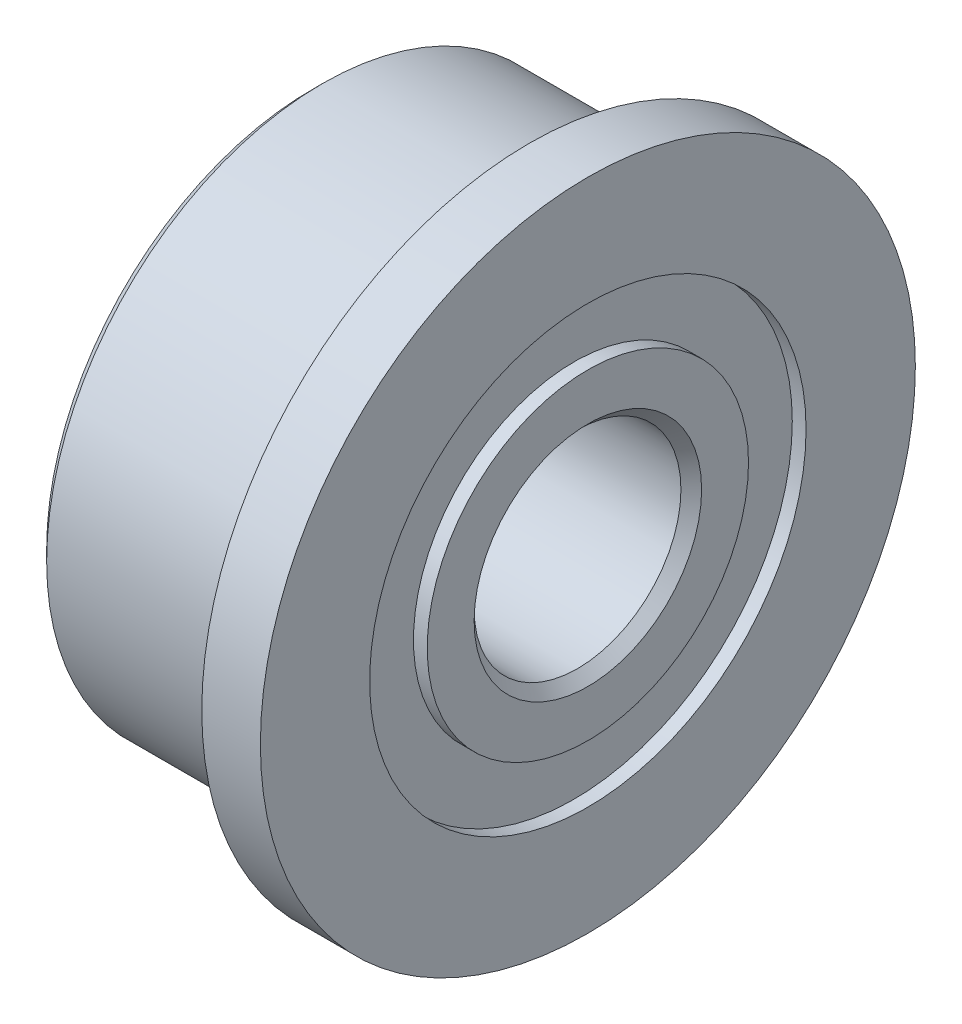
ISO-10303-21;
HEADER;
FILE_DESCRIPTION(('STEP AP214'),'2;1');
FILE_NAME('part.step','',(''),(''),'','','');
FILE_SCHEMA(('AUTOMOTIVE_DESIGN { 1 0 10303 214 1 1 1 1 }'));
ENDSEC;
DATA;
#1=APPLICATION_CONTEXT('core data for automotive mechanical design processes');
#2=APPLICATION_PROTOCOL_DEFINITION('international standard','automotive_design',2000,#1);
#3=PRODUCT_CONTEXT('',#1,'mechanical');
#4=PRODUCT('Part','Part','',(#3));
#5=PRODUCT_RELATED_PRODUCT_CATEGORY('part','',(#4));
#6=PRODUCT_DEFINITION_FORMATION('','',#4);
#7=PRODUCT_DEFINITION_CONTEXT('part definition',#1,'design');
#8=PRODUCT_DEFINITION('design','',#6,#7);
#9=PRODUCT_DEFINITION_SHAPE('','',#8);
#10=(LENGTH_UNIT() NAMED_UNIT(*) SI_UNIT(.MILLI.,.METRE.));
#11=(NAMED_UNIT(*) PLANE_ANGLE_UNIT() SI_UNIT($,.RADIAN.));
#12=(NAMED_UNIT(*) SI_UNIT($,.STERADIAN.) SOLID_ANGLE_UNIT());
#13=UNCERTAINTY_MEASURE_WITH_UNIT(LENGTH_MEASURE(1.E-05),#10,'distance_accuracy_value','');
#14=(GEOMETRIC_REPRESENTATION_CONTEXT(3) GLOBAL_UNCERTAINTY_ASSIGNED_CONTEXT((#13)) GLOBAL_UNIT_ASSIGNED_CONTEXT((#10,
#11,#12)) REPRESENTATION_CONTEXT('',''));
#15=CARTESIAN_POINT('',(0.,0.,0.));
#16=DIRECTION('',(0.,0.,1.));
#17=DIRECTION('',(1.,0.,0.));
#18=AXIS2_PLACEMENT_3D('',#15,#16,#17);
#19=CARTESIAN_POINT('',(-4.,2.33,0.));
#20=DIRECTION('',(-1.,0.,0.));
#21=DIRECTION('',(0.,0.,1.));
#22=AXIS2_PLACEMENT_3D('',#19,#20,#21);
#23=PLANE('',#22);
#24=CARTESIAN_POINT('',(-4.,0.,0.));
#25=DIRECTION('',(-1.,0.,0.));
#26=DIRECTION('',(0.,0.,1.));
#27=AXIS2_PLACEMENT_3D('',#24,#25,#26);
#28=CIRCLE('',#27,1.65);
#29=CARTESIAN_POINT('',(-4.,0.,1.65));
#30=VERTEX_POINT('',#29);
#31=EDGE_CURVE('E42',#30,#30,#28,.F.);
#32=ORIENTED_EDGE('',*,*,#31,.T.);
#33=EDGE_LOOP('',(#32));
#34=FACE_BOUND('',#33,.T.);
#35=CARTESIAN_POINT('',(-4.,0.,0.));
#36=DIRECTION('',(1.,0.,0.));
#37=DIRECTION('',(0.,0.,-1.));
#38=AXIS2_PLACEMENT_3D('',#35,#36,#37);
#39=CIRCLE('',#38,2.33);
#40=CARTESIAN_POINT('',(-4.,0.,-2.33));
#41=VERTEX_POINT('',#40);
#42=EDGE_CURVE('E90',#41,#41,#39,.T.);
#43=ORIENTED_EDGE('',*,*,#42,.F.);
#44=EDGE_LOOP('',(#43));
#45=FACE_BOUND('',#44,.T.);
#46=ADVANCED_FACE('F32',(#34,#45),#23,.T.);
#47=CARTESIAN_POINT('',(0.,0.,0.));
#48=DIRECTION('',(1.,0.,0.));
#49=DIRECTION('',(0.,0.,-1.));
#50=AXIS2_PLACEMENT_3D('',#47,#48,#49);
#51=CYLINDRICAL_SURFACE('',#50,1.5);
#52=CARTESIAN_POINT('',(-0.149999999999999,0.,0.));
#53=DIRECTION('',(1.,0.,0.));
#54=DIRECTION('',(0.,0.,-1.));
#55=AXIS2_PLACEMENT_3D('',#52,#53,#54);
#56=CIRCLE('',#55,1.5);
#57=CARTESIAN_POINT('',(-0.149999999999999,0.,-1.5));
#58=VERTEX_POINT('',#57);
#59=EDGE_CURVE('E51',#58,#58,#56,.T.);
#60=ORIENTED_EDGE('',*,*,#59,.T.);
#61=EDGE_LOOP('',(#60));
#62=FACE_BOUND('',#61,.T.);
#63=CARTESIAN_POINT('',(-3.85,0.,0.));
#64=DIRECTION('',(-1.,0.,0.));
#65=DIRECTION('',(0.,0.,1.));
#66=AXIS2_PLACEMENT_3D('',#63,#64,#65);
#67=CIRCLE('',#66,1.5);
#68=CARTESIAN_POINT('',(-3.85,0.,1.5));
#69=VERTEX_POINT('',#68);
#70=EDGE_CURVE('E54',#69,#69,#67,.T.);
#71=ORIENTED_EDGE('',*,*,#70,.T.);
#72=EDGE_LOOP('',(#71));
#73=FACE_BOUND('',#72,.T.);
#74=ADVANCED_FACE('F98',(#62,#73),#51,.F.);
#75=CARTESIAN_POINT('',(0.,1.5,0.));
#76=DIRECTION('',(1.,0.,0.));
#77=DIRECTION('',(0.,0.,-1.));
#78=AXIS2_PLACEMENT_3D('',#75,#76,#77);
#79=PLANE('',#78);
#80=CARTESIAN_POINT('',(0.,0.,0.));
#81=DIRECTION('',(1.,0.,0.));
#82=DIRECTION('',(0.,0.,-1.));
#83=AXIS2_PLACEMENT_3D('',#80,#81,#82);
#84=CIRCLE('',#83,1.65);
#85=CARTESIAN_POINT('',(0.,0.,-1.65));
#86=VERTEX_POINT('',#85);
#87=EDGE_CURVE('E46',#86,#86,#84,.F.);
#88=ORIENTED_EDGE('',*,*,#87,.T.);
#89=EDGE_LOOP('',(#88));
#90=FACE_BOUND('',#89,.T.);
#91=CARTESIAN_POINT('',(0.,0.,0.));
#92=DIRECTION('',(1.,0.,0.));
#93=DIRECTION('',(0.,0.,-1.));
#94=AXIS2_PLACEMENT_3D('',#91,#92,#93);
#95=CIRCLE('',#94,2.33);
#96=CARTESIAN_POINT('',(0.,0.,-2.33));
#97=VERTEX_POINT('',#96);
#98=EDGE_CURVE('E57',#97,#97,#95,.T.);
#99=ORIENTED_EDGE('',*,*,#98,.T.);
#100=EDGE_LOOP('',(#99));
#101=FACE_BOUND('',#100,.T.);
#102=ADVANCED_FACE('F103',(#90,#101),#79,.T.);
#103=CARTESIAN_POINT('',(0.,0.,0.));
#104=DIRECTION('',(1.,0.,0.));
#105=DIRECTION('',(0.,0.,-1.));
#106=AXIS2_PLACEMENT_3D('',#103,#104,#105);
#107=CYLINDRICAL_SURFACE('',#106,2.33);
#108=CARTESIAN_POINT('',(-0.2,0.,0.));
#109=DIRECTION('',(1.,0.,0.));
#110=DIRECTION('',(0.,0.,-1.));
#111=AXIS2_PLACEMENT_3D('',#108,#109,#110);
#112=CIRCLE('',#111,2.33);
#113=CARTESIAN_POINT('',(-0.2,0.,-2.33));
#114=VERTEX_POINT('',#113);
#115=EDGE_CURVE('E60',#114,#114,#112,.T.);
#116=ORIENTED_EDGE('',*,*,#115,.T.);
#117=EDGE_LOOP('',(#116));
#118=FACE_BOUND('',#117,.T.);
#119=ORIENTED_EDGE('',*,*,#98,.F.);
#120=EDGE_LOOP('',(#119));
#121=FACE_BOUND('',#120,.T.);
#122=ADVANCED_FACE('F162',(#118,#121),#107,.T.);
#123=CARTESIAN_POINT('',(-0.2,3.165,0.));
#124=DIRECTION('',(1.,0.,0.));
#125=DIRECTION('',(0.,0.,-1.));
#126=AXIS2_PLACEMENT_3D('',#123,#124,#125);
#127=PLANE('',#126);
#128=CARTESIAN_POINT('',(-0.2,0.,0.));
#129=DIRECTION('',(1.,0.,0.));
#130=DIRECTION('',(0.,0.,-1.));
#131=AXIS2_PLACEMENT_3D('',#128,#129,#130);
#132=CIRCLE('',#131,3.165);
#133=CARTESIAN_POINT('',(-0.2,0.,-3.165));
#134=VERTEX_POINT('',#133);
#135=EDGE_CURVE('E63',#134,#134,#132,.T.);
#136=ORIENTED_EDGE('',*,*,#135,.T.);
#137=EDGE_LOOP('',(#136));
#138=FACE_BOUND('',#137,.T.);
#139=ORIENTED_EDGE('',*,*,#115,.F.);
#140=EDGE_LOOP('',(#139));
#141=FACE_BOUND('',#140,.T.);
#142=ADVANCED_FACE('F158',(#138,#141),#127,.T.);
#143=CARTESIAN_POINT('',(0.,0.,0.));
#144=DIRECTION('',(1.,0.,0.));
#145=DIRECTION('',(0.,0.,-1.));
#146=AXIS2_PLACEMENT_3D('',#143,#144,#145);
#147=CYLINDRICAL_SURFACE('',#146,3.165);
#148=CARTESIAN_POINT('',(0.,0.,0.));
#149=DIRECTION('',(1.,0.,0.));
#150=DIRECTION('',(0.,0.,-1.));
#151=AXIS2_PLACEMENT_3D('',#148,#149,#150);
#152=CIRCLE('',#151,3.165);
#153=CARTESIAN_POINT('',(0.,0.,-3.165));
#154=VERTEX_POINT('',#153);
#155=EDGE_CURVE('E66',#154,#154,#152,.T.);
#156=ORIENTED_EDGE('',*,*,#155,.T.);
#157=EDGE_LOOP('',(#156));
#158=FACE_BOUND('',#157,.T.);
#159=ORIENTED_EDGE('',*,*,#135,.F.);
#160=EDGE_LOOP('',(#159));
#161=FACE_BOUND('',#160,.T.);
#162=ADVANCED_FACE('F154',(#158,#161),#147,.F.);
#163=CARTESIAN_POINT('',(0.,3.165,0.));
#164=DIRECTION('',(1.,0.,0.));
#165=DIRECTION('',(0.,0.,-1.));
#166=AXIS2_PLACEMENT_3D('',#163,#164,#165);
#167=PLANE('',#166);
#168=CARTESIAN_POINT('',(0.,0.,0.));
#169=DIRECTION('',(1.,0.,0.));
#170=DIRECTION('',(0.,0.,-1.));
#171=AXIS2_PLACEMENT_3D('',#168,#169,#170);
#172=CIRCLE('',#171,4.75);
#173=CARTESIAN_POINT('',(0.,0.,-4.75));
#174=VERTEX_POINT('',#173);
#175=EDGE_CURVE('E69',#174,#174,#172,.T.);
#176=ORIENTED_EDGE('',*,*,#175,.T.);
#177=EDGE_LOOP('',(#176));
#178=FACE_BOUND('',#177,.T.);
#179=ORIENTED_EDGE('',*,*,#155,.F.);
#180=EDGE_LOOP('',(#179));
#181=FACE_BOUND('',#180,.T.);
#182=ADVANCED_FACE('F150',(#178,#181),#167,.T.);
#183=CARTESIAN_POINT('',(0.,0.,0.));
#184=DIRECTION('',(1.,0.,0.));
#185=DIRECTION('',(0.,0.,-1.));
#186=AXIS2_PLACEMENT_3D('',#183,#184,#185);
#187=CYLINDRICAL_SURFACE('',#186,4.75);
#188=CARTESIAN_POINT('',(-0.85,0.,0.));
#189=DIRECTION('',(1.,0.,0.));
#190=DIRECTION('',(0.,0.,-1.));
#191=AXIS2_PLACEMENT_3D('',#188,#189,#190);
#192=CIRCLE('',#191,4.75);
#193=CARTESIAN_POINT('',(-0.85,0.,-4.75));
#194=VERTEX_POINT('',#193);
#195=EDGE_CURVE('E72',#194,#194,#192,.T.);
#196=ORIENTED_EDGE('',*,*,#195,.T.);
#197=EDGE_LOOP('',(#196));
#198=FACE_BOUND('',#197,.T.);
#199=ORIENTED_EDGE('',*,*,#175,.F.);
#200=EDGE_LOOP('',(#199));
#201=FACE_BOUND('',#200,.T.);
#202=ADVANCED_FACE('F146',(#198,#201),#187,.T.);
#203=CARTESIAN_POINT('',(-0.85,4.75,0.));
#204=DIRECTION('',(-1.,0.,0.));
#205=DIRECTION('',(0.,0.,1.));
#206=AXIS2_PLACEMENT_3D('',#203,#204,#205);
#207=PLANE('',#206);
#208=CARTESIAN_POINT('',(-0.85,0.,0.));
#209=DIRECTION('',(1.,0.,0.));
#210=DIRECTION('',(0.,0.,-1.));
#211=AXIS2_PLACEMENT_3D('',#208,#209,#210);
#212=CIRCLE('',#211,4.02);
#213=CARTESIAN_POINT('',(-0.85,0.,-4.02));
#214=VERTEX_POINT('',#213);
#215=EDGE_CURVE('E75',#214,#214,#212,.T.);
#216=ORIENTED_EDGE('',*,*,#215,.T.);
#217=EDGE_LOOP('',(#216));
#218=FACE_BOUND('',#217,.T.);
#219=ORIENTED_EDGE('',*,*,#195,.F.);
#220=EDGE_LOOP('',(#219));
#221=FACE_BOUND('',#220,.T.);
#222=ADVANCED_FACE('F142',(#218,#221),#207,.T.);
#223=CARTESIAN_POINT('',(-0.85,0.,0.));
#224=DIRECTION('',(1.,0.,0.));
#225=DIRECTION('',(0.,0.,-1.));
#226=AXIS2_PLACEMENT_3D('',#223,#224,#225);
#227=TOROIDAL_SURFACE('',#226,4.,0.0200000000000001);
#228=CARTESIAN_POINT('',(-0.87,0.,0.));
#229=DIRECTION('',(1.,0.,0.));
#230=DIRECTION('',(0.,0.,-1.));
#231=AXIS2_PLACEMENT_3D('',#228,#229,#230);
#232=CIRCLE('',#231,4.);
#233=CARTESIAN_POINT('',(-0.87,0.,-4.));
#234=VERTEX_POINT('',#233);
#235=EDGE_CURVE('E78',#234,#234,#232,.T.);
#236=ORIENTED_EDGE('',*,*,#235,.T.);
#237=EDGE_LOOP('',(#236));
#238=FACE_BOUND('',#237,.T.);
#239=ORIENTED_EDGE('',*,*,#215,.F.);
#240=EDGE_LOOP('',(#239));
#241=FACE_BOUND('',#240,.T.);
#242=ADVANCED_FACE('F139',(#238,#241),#227,.F.);
#243=CARTESIAN_POINT('',(0.,0.,0.));
#244=DIRECTION('',(1.,0.,0.));
#245=DIRECTION('',(0.,0.,-1.));
#246=AXIS2_PLACEMENT_3D('',#243,#244,#245);
#247=CYLINDRICAL_SURFACE('',#246,4.);
#248=CARTESIAN_POINT('',(-3.85,0.,0.));
#249=DIRECTION('',(-1.,0.,0.));
#250=DIRECTION('',(0.,0.,1.));
#251=AXIS2_PLACEMENT_3D('',#248,#249,#250);
#252=CIRCLE('',#251,4.);
#253=CARTESIAN_POINT('',(-3.85,0.,4.));
#254=VERTEX_POINT('',#253);
#255=EDGE_CURVE('E38',#254,#254,#252,.F.);
#256=ORIENTED_EDGE('',*,*,#255,.T.);
#257=EDGE_LOOP('',(#256));
#258=FACE_BOUND('',#257,.T.);
#259=ORIENTED_EDGE('',*,*,#235,.F.);
#260=EDGE_LOOP('',(#259));
#261=FACE_BOUND('',#260,.T.);
#262=ADVANCED_FACE('F136',(#258,#261),#247,.T.);
#263=CARTESIAN_POINT('',(-4.,4.,0.));
#264=DIRECTION('',(-1.,0.,0.));
#265=DIRECTION('',(0.,0.,1.));
#266=AXIS2_PLACEMENT_3D('',#263,#264,#265);
#267=PLANE('',#266);
#268=CARTESIAN_POINT('',(-4.,0.,0.));
#269=DIRECTION('',(-1.,0.,0.));
#270=DIRECTION('',(0.,0.,1.));
#271=AXIS2_PLACEMENT_3D('',#268,#269,#270);
#272=CIRCLE('',#271,3.85);
#273=CARTESIAN_POINT('',(-4.,0.,3.85));
#274=VERTEX_POINT('',#273);
#275=EDGE_CURVE('E10',#274,#274,#272,.T.);
#276=ORIENTED_EDGE('',*,*,#275,.T.);
#277=EDGE_LOOP('',(#276));
#278=FACE_BOUND('',#277,.T.);
#279=CARTESIAN_POINT('',(-4.,0.,0.));
#280=DIRECTION('',(1.,0.,0.));
#281=DIRECTION('',(0.,0.,-1.));
#282=AXIS2_PLACEMENT_3D('',#279,#280,#281);
#283=CIRCLE('',#282,3.165);
#284=CARTESIAN_POINT('',(-4.,0.,-3.165));
#285=VERTEX_POINT('',#284);
#286=EDGE_CURVE('E81',#285,#285,#283,.T.);
#287=ORIENTED_EDGE('',*,*,#286,.T.);
#288=EDGE_LOOP('',(#287));
#289=FACE_BOUND('',#288,.T.);
#290=ADVANCED_FACE('F132',(#278,#289),#267,.T.);
#291=CARTESIAN_POINT('',(0.,0.,0.));
#292=DIRECTION('',(1.,0.,0.));
#293=DIRECTION('',(0.,0.,-1.));
#294=AXIS2_PLACEMENT_3D('',#291,#292,#293);
#295=CYLINDRICAL_SURFACE('',#294,3.165);
#296=CARTESIAN_POINT('',(-3.8,0.,0.));
#297=DIRECTION('',(1.,0.,0.));
#298=DIRECTION('',(0.,0.,-1.));
#299=AXIS2_PLACEMENT_3D('',#296,#297,#298);
#300=CIRCLE('',#299,3.165);
#301=CARTESIAN_POINT('',(-3.8,0.,-3.165));
#302=VERTEX_POINT('',#301);
#303=EDGE_CURVE('E84',#302,#302,#300,.T.);
#304=ORIENTED_EDGE('',*,*,#303,.T.);
#305=EDGE_LOOP('',(#304));
#306=FACE_BOUND('',#305,.T.);
#307=ORIENTED_EDGE('',*,*,#286,.F.);
#308=EDGE_LOOP('',(#307));
#309=FACE_BOUND('',#308,.T.);
#310=ADVANCED_FACE('F128',(#306,#309),#295,.F.);
#311=CARTESIAN_POINT('',(-3.8,3.165,0.));
#312=DIRECTION('',(-1.,0.,0.));
#313=DIRECTION('',(0.,0.,1.));
#314=AXIS2_PLACEMENT_3D('',#311,#312,#313);
#315=PLANE('',#314);
#316=CARTESIAN_POINT('',(-3.8,0.,0.));
#317=DIRECTION('',(1.,0.,0.));
#318=DIRECTION('',(0.,0.,-1.));
#319=AXIS2_PLACEMENT_3D('',#316,#317,#318);
#320=CIRCLE('',#319,2.33);
#321=CARTESIAN_POINT('',(-3.8,0.,-2.33));
#322=VERTEX_POINT('',#321);
#323=EDGE_CURVE('E87',#322,#322,#320,.T.);
#324=ORIENTED_EDGE('',*,*,#323,.T.);
#325=EDGE_LOOP('',(#324));
#326=FACE_BOUND('',#325,.T.);
#327=ORIENTED_EDGE('',*,*,#303,.F.);
#328=EDGE_LOOP('',(#327));
#329=FACE_BOUND('',#328,.T.);
#330=ADVANCED_FACE('F125',(#326,#329),#315,.T.);
#331=CARTESIAN_POINT('',(0.,0.,0.));
#332=DIRECTION('',(1.,0.,0.));
#333=DIRECTION('',(0.,0.,-1.));
#334=AXIS2_PLACEMENT_3D('',#331,#332,#333);
#335=CYLINDRICAL_SURFACE('',#334,2.33);
#336=ORIENTED_EDGE('',*,*,#42,.T.);
#337=EDGE_LOOP('',(#336));
#338=FACE_BOUND('',#337,.T.);
#339=ORIENTED_EDGE('',*,*,#323,.F.);
#340=EDGE_LOOP('',(#339));
#341=FACE_BOUND('',#340,.T.);
#342=ADVANCED_FACE('F94',(#338,#341),#335,.T.);
#343=CARTESIAN_POINT('',(-0.149999999999999,0.,0.));
#344=DIRECTION('',(1.,0.,0.));
#345=DIRECTION('',(0.,0.,-1.));
#346=AXIS2_PLACEMENT_3D('',#343,#344,#345);
#347=CONICAL_SURFACE('',#346,1.5,0.785398163397449);
#348=ORIENTED_EDGE('',*,*,#87,.F.);
#349=EDGE_LOOP('',(#348));
#350=FACE_BOUND('',#349,.T.);
#351=ORIENTED_EDGE('',*,*,#59,.F.);
#352=EDGE_LOOP('',(#351));
#353=FACE_BOUND('',#352,.T.);
#354=ADVANCED_FACE('F110',(#350,#353),#347,.F.);
#355=CARTESIAN_POINT('',(-4.,0.,0.));
#356=DIRECTION('',(-1.,0.,0.));
#357=DIRECTION('',(0.,0.,1.));
#358=AXIS2_PLACEMENT_3D('',#355,#356,#357);
#359=CONICAL_SURFACE('',#358,1.65,0.785398163397447);
#360=ORIENTED_EDGE('',*,*,#70,.F.);
#361=EDGE_LOOP('',(#360));
#362=FACE_BOUND('',#361,.T.);
#363=ORIENTED_EDGE('',*,*,#31,.F.);
#364=EDGE_LOOP('',(#363));
#365=FACE_BOUND('',#364,.T.);
#366=ADVANCED_FACE('F107',(#362,#365),#359,.F.);
#367=CARTESIAN_POINT('',(-3.85,0.,0.));
#368=DIRECTION('',(1.,0.,0.));
#369=DIRECTION('',(0.,0.,-1.));
#370=AXIS2_PLACEMENT_3D('',#367,#368,#369);
#371=CONICAL_SURFACE('',#370,4.,0.785398163397448);
#372=ORIENTED_EDGE('',*,*,#275,.F.);
#373=EDGE_LOOP('',(#372));
#374=FACE_BOUND('',#373,.T.);
#375=ORIENTED_EDGE('',*,*,#255,.F.);
#376=EDGE_LOOP('',(#375));
#377=FACE_BOUND('',#376,.T.);
#378=ADVANCED_FACE('F109',(#374,#377),#371,.T.);
#379=CLOSED_SHELL('',(#46,#74,#102,#122,#142,#162,#182,#202,#222,#242,#262,#290,#310,#330,#342,
#354,#366,#378));
#380=MANIFOLD_SOLID_BREP('B2',#379);
#381=ADVANCED_BREP_SHAPE_REPRESENTATION('',(#18,#380),#14);
#382=SHAPE_DEFINITION_REPRESENTATION(#9,#381);
ENDSEC;
END-ISO-10303-21;
